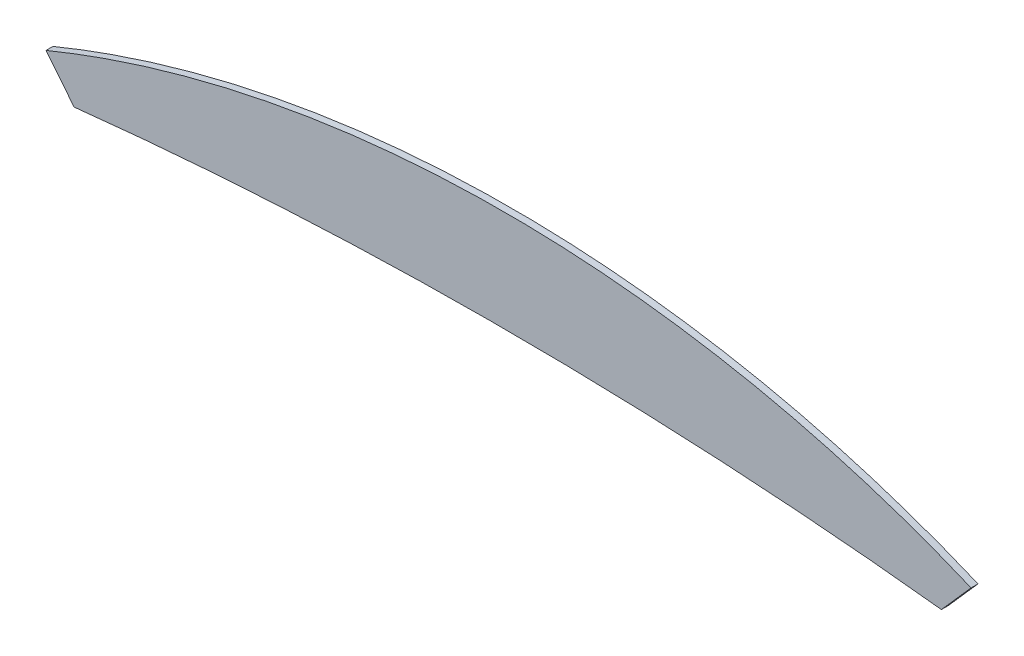
ISO-10303-21;
HEADER;
FILE_DESCRIPTION(('STEP AP214'),'2;1');
FILE_NAME('part.step','',(''),(''),'','','');
FILE_SCHEMA(('AUTOMOTIVE_DESIGN { 1 0 10303 214 1 1 1 1 }'));
ENDSEC;
DATA;
#1=APPLICATION_CONTEXT('core data for automotive mechanical design processes');
#2=APPLICATION_PROTOCOL_DEFINITION('international standard','automotive_design',2000,#1);
#3=PRODUCT_CONTEXT('',#1,'mechanical');
#4=PRODUCT('Part','Part','',(#3));
#5=PRODUCT_RELATED_PRODUCT_CATEGORY('part','',(#4));
#6=PRODUCT_DEFINITION_FORMATION('','',#4);
#7=PRODUCT_DEFINITION_CONTEXT('part definition',#1,'design');
#8=PRODUCT_DEFINITION('design','',#6,#7);
#9=PRODUCT_DEFINITION_SHAPE('','',#8);
#10=(LENGTH_UNIT() NAMED_UNIT(*) SI_UNIT(.MILLI.,.METRE.));
#11=(NAMED_UNIT(*) PLANE_ANGLE_UNIT() SI_UNIT($,.RADIAN.));
#12=(NAMED_UNIT(*) SI_UNIT($,.STERADIAN.) SOLID_ANGLE_UNIT());
#13=UNCERTAINTY_MEASURE_WITH_UNIT(LENGTH_MEASURE(1.E-05),#10,'distance_accuracy_value','');
#14=(GEOMETRIC_REPRESENTATION_CONTEXT(3) GLOBAL_UNCERTAINTY_ASSIGNED_CONTEXT((#13)) GLOBAL_UNIT_ASSIGNED_CONTEXT((#10,
#11,#12)) REPRESENTATION_CONTEXT('',''));
#15=CARTESIAN_POINT('',(0.,0.,0.));
#16=DIRECTION('',(0.,0.,1.));
#17=DIRECTION('',(1.,0.,0.));
#18=AXIS2_PLACEMENT_3D('',#15,#16,#17);
#19=CARTESIAN_POINT('',(45.6834775369586,30.1136495265154,0.1));
#20=CARTESIAN_POINT('',(51.9495722313651,30.793564023917,0.1));
#21=CARTESIAN_POINT('',(58.2118071714674,30.0912594323867,0.1));
#22=(BOUNDED_CURVE() B_SPLINE_CURVE(2,(#19,#20,#21),.UNSPECIFIED.,.F.,
.F.) B_SPLINE_CURVE_WITH_KNOTS((3,3),(1.96165351289814,2.23574331225039),
.UNSPECIFIED.) CURVE() GEOMETRIC_REPRESENTATION_ITEM() RATIONAL_B_SPLINE_CURVE((1.,
0.990624035929916,1.)) REPRESENTATION_ITEM(''));
#23=DIRECTION('',(0.,0.,-1.));
#24=VECTOR('',#23,1.);
#25=SURFACE_OF_LINEAR_EXTRUSION('',#22,#24);
#26=CARTESIAN_POINT('',(45.6834775369586,30.1136495265154,0.));
#27=CARTESIAN_POINT('',(51.9495722313651,30.793564023917,0.));
#28=CARTESIAN_POINT('',(58.2118071714674,30.0912594323867,0.));
#29=(BOUNDED_CURVE() B_SPLINE_CURVE(2,(#26,#27,#28),.UNSPECIFIED.,.F.,
.F.) B_SPLINE_CURVE_WITH_KNOTS((3,3),(1.96165351289814,2.23574331225039),
.UNSPECIFIED.) CURVE() GEOMETRIC_REPRESENTATION_ITEM() RATIONAL_B_SPLINE_CURVE((1.,
0.990624035929916,1.)) REPRESENTATION_ITEM(''));
#30=CARTESIAN_POINT('',(45.6834775369586,30.1136495265154,0.));
#31=VERTEX_POINT('',#30);
#32=CARTESIAN_POINT('',(58.2118071714674,30.0912594323867,0.));
#33=VERTEX_POINT('',#32);
#34=EDGE_CURVE('E120',#31,#33,#29,.T.);
#35=ORIENTED_EDGE('',*,*,#34,.T.);
#36=DIRECTION('',(0.,0.,-1.));
#37=VECTOR('',#36,1.);
#38=CARTESIAN_POINT('',(58.2118071714674,30.0912594323867,0.1));
#39=LINE('',#38,#37);
#40=CARTESIAN_POINT('',(58.2118071714674,30.0912594323867,0.1));
#41=VERTEX_POINT('',#40);
#42=EDGE_CURVE('E11',#41,#33,#39,.T.);
#43=ORIENTED_EDGE('',*,*,#42,.F.);
#44=CARTESIAN_POINT('',(45.6834775369586,30.1136495265154,0.1));
#45=VERTEX_POINT('',#44);
#46=EDGE_CURVE('E85',#45,#41,#22,.T.);
#47=ORIENTED_EDGE('',*,*,#46,.F.);
#48=DIRECTION('',(0.,0.,-1.));
#49=VECTOR('',#48,1.);
#50=CARTESIAN_POINT('',(45.6834775369586,30.1136495265154,0.1));
#51=LINE('',#50,#49);
#52=EDGE_CURVE('E93',#45,#31,#51,.T.);
#53=ORIENTED_EDGE('',*,*,#52,.T.);
#54=EDGE_LOOP('',(#35,#43,#47,#53));
#55=FACE_BOUND('',#54,.T.);
#56=ADVANCED_FACE('F33',(#55),#25,.F.);
#57=CARTESIAN_POINT('',(58.2118071714674,30.0912594323867,0.1));
#58=DIRECTION('',(-0.749928942685465,0.661518390464438,0.));
#59=DIRECTION('',(-0.661518390464438,-0.749928942685465,0.));
#60=AXIS2_PLACEMENT_3D('',#57,#58,#59);
#61=PLANE('',#60);
#62=CARTESIAN_POINT('',(58.2118071714674,30.0912594323867,0.));
#63=CARTESIAN_POINT('',(58.4261049720102,30.3341976867079,0.));
#64=CARTESIAN_POINT('',(58.6404027725529,30.5771359410291,0.));
#65=(BOUNDED_CURVE() B_SPLINE_CURVE(2,(#62,#63,#64),.UNSPECIFIED.,.F.,
.F.) B_SPLINE_CURVE_WITH_KNOTS((3,3),(0.961653512898143,1.96165351289814),
.UNSPECIFIED.) CURVE() GEOMETRIC_REPRESENTATION_ITEM() RATIONAL_B_SPLINE_CURVE((1.,1.,1.)) REPRESENTATION_ITEM(''));
#66=CARTESIAN_POINT('',(58.6404027725529,30.5771359410291,0.));
#67=VERTEX_POINT('',#66);
#68=EDGE_CURVE('E89',#33,#67,#65,.T.);
#69=ORIENTED_EDGE('',*,*,#68,.T.);
#70=DIRECTION('',(0.,0.,-1.));
#71=VECTOR('',#70,1.);
#72=CARTESIAN_POINT('',(58.6404027725529,30.5771359410291,0.1));
#73=LINE('',#72,#71);
#74=CARTESIAN_POINT('',(58.6404027725529,30.5771359410291,0.1));
#75=VERTEX_POINT('',#74);
#76=EDGE_CURVE('E42',#75,#67,#73,.T.);
#77=ORIENTED_EDGE('',*,*,#76,.F.);
#78=CARTESIAN_POINT('',(58.2118071714674,30.0912594323867,0.1));
#79=CARTESIAN_POINT('',(58.4261049720102,30.3341976867079,0.1));
#80=CARTESIAN_POINT('',(58.6404027725529,30.5771359410291,0.1));
#81=(BOUNDED_CURVE() B_SPLINE_CURVE(2,(#78,#79,#80),.UNSPECIFIED.,.F.,
.F.) B_SPLINE_CURVE_WITH_KNOTS((3,3),(0.961653512898143,1.96165351289814),
.UNSPECIFIED.) CURVE() GEOMETRIC_REPRESENTATION_ITEM() RATIONAL_B_SPLINE_CURVE((1.,1.,1.)) REPRESENTATION_ITEM(''));
#82=EDGE_CURVE('E80',#41,#75,#81,.T.);
#83=ORIENTED_EDGE('',*,*,#82,.F.);
#84=ORIENTED_EDGE('',*,*,#42,.T.);
#85=EDGE_LOOP('',(#69,#77,#83,#84));
#86=FACE_BOUND('',#85,.T.);
#87=ADVANCED_FACE('F88',(#86),#61,.F.);
#88=CARTESIAN_POINT('',(58.6404027725529,30.5771359410291,0.1));
#89=CARTESIAN_POINT('',(51.9726361940467,33.3866438042224,0.1));
#90=CARTESIAN_POINT('',(45.2773428980342,30.6193498043254,0.1));
#91=(BOUNDED_CURVE() B_SPLINE_CURVE(2,(#88,#89,#90),.UNSPECIFIED.,.F.,
.F.) B_SPLINE_CURVE_WITH_KNOTS((3,3),(0.,0.961653512898143),
.UNSPECIFIED.) CURVE() GEOMETRIC_REPRESENTATION_ITEM() RATIONAL_B_SPLINE_CURVE((1.,
0.886612840769222,1.)) REPRESENTATION_ITEM(''));
#92=DIRECTION('',(0.,0.,-1.));
#93=VECTOR('',#92,1.);
#94=SURFACE_OF_LINEAR_EXTRUSION('',#91,#93);
#95=CARTESIAN_POINT('',(58.6404027725529,30.5771359410291,0.));
#96=CARTESIAN_POINT('',(51.9726361940467,33.3866438042224,0.));
#97=CARTESIAN_POINT('',(45.2773428980342,30.6193498043254,0.));
#98=(BOUNDED_CURVE() B_SPLINE_CURVE(2,(#95,#96,#97),.UNSPECIFIED.,.F.,
.F.) B_SPLINE_CURVE_WITH_KNOTS((3,3),(0.,0.961653512898143),
.UNSPECIFIED.) CURVE() GEOMETRIC_REPRESENTATION_ITEM() RATIONAL_B_SPLINE_CURVE((1.,
0.886612840769222,1.)) REPRESENTATION_ITEM(''));
#99=CARTESIAN_POINT('',(45.2773428980341,30.6193498043253,0.));
#100=VERTEX_POINT('',#99);
#101=EDGE_CURVE('E67',#67,#100,#98,.T.);
#102=ORIENTED_EDGE('',*,*,#101,.T.);
#103=DIRECTION('',(0.,0.,-1.));
#104=VECTOR('',#103,1.);
#105=CARTESIAN_POINT('',(45.2773428980341,30.6193498043253,0.1));
#106=LINE('',#105,#104);
#107=CARTESIAN_POINT('',(45.2773428980341,30.6193498043253,0.1));
#108=VERTEX_POINT('',#107);
#109=EDGE_CURVE('E90',#108,#100,#106,.T.);
#110=ORIENTED_EDGE('',*,*,#109,.F.);
#111=EDGE_CURVE('E83',#75,#108,#91,.T.);
#112=ORIENTED_EDGE('',*,*,#111,.F.);
#113=ORIENTED_EDGE('',*,*,#76,.T.);
#114=EDGE_LOOP('',(#102,#110,#112,#113));
#115=FACE_BOUND('',#114,.T.);
#116=ADVANCED_FACE('F91',(#115),#94,.F.);
#117=CARTESIAN_POINT('',(45.2773428980341,30.6193498043253,0.1));
#118=DIRECTION('',(0.779683299889577,0.626174058767449,0.));
#119=DIRECTION('',(-0.626174058767449,0.779683299889577,0.));
#120=AXIS2_PLACEMENT_3D('',#117,#118,#119);
#121=PLANE('',#120);
#122=CARTESIAN_POINT('',(45.2773428980341,30.6193498043253,0.));
#123=CARTESIAN_POINT('',(45.4804102174963,30.3664996654204,0.));
#124=CARTESIAN_POINT('',(45.6834775369586,30.1136495265154,0.));
#125=(BOUNDED_CURVE() B_SPLINE_CURVE(2,(#122,#123,#124),.UNSPECIFIED.,.F.,
.F.) B_SPLINE_CURVE_WITH_KNOTS((3,3),(2.23574331225039,3.23574331225039),
.UNSPECIFIED.) CURVE() GEOMETRIC_REPRESENTATION_ITEM() RATIONAL_B_SPLINE_CURVE((1.,1.,1.)) REPRESENTATION_ITEM(''));
#126=EDGE_CURVE('E73',#100,#31,#125,.T.);
#127=ORIENTED_EDGE('',*,*,#126,.T.);
#128=ORIENTED_EDGE('',*,*,#52,.F.);
#129=CARTESIAN_POINT('',(45.2773428980341,30.6193498043253,0.1));
#130=CARTESIAN_POINT('',(45.4804102174963,30.3664996654204,0.1));
#131=CARTESIAN_POINT('',(45.6834775369586,30.1136495265154,0.1));
#132=(BOUNDED_CURVE() B_SPLINE_CURVE(2,(#129,#130,#131),.UNSPECIFIED.,.F.,
.F.) B_SPLINE_CURVE_WITH_KNOTS((3,3),(2.23574331225039,3.23574331225039),
.UNSPECIFIED.) CURVE() GEOMETRIC_REPRESENTATION_ITEM() RATIONAL_B_SPLINE_CURVE((1.,1.,1.)) REPRESENTATION_ITEM(''));
#133=EDGE_CURVE('E50',#108,#45,#132,.T.);
#134=ORIENTED_EDGE('',*,*,#133,.F.);
#135=ORIENTED_EDGE('',*,*,#109,.T.);
#136=EDGE_LOOP('',(#127,#128,#134,#135));
#137=FACE_BOUND('',#136,.T.);
#138=ADVANCED_FACE('F109',(#137),#121,.F.);
#139=CARTESIAN_POINT('',(51.9486027478678,30.4463816670321,0.1));
#140=DIRECTION('',(0.,0.,-1.));
#141=DIRECTION('',(-1.,0.,0.));
#142=AXIS2_PLACEMENT_3D('',#139,#140,#141);
#143=PLANE('',#142);
#144=ORIENTED_EDGE('',*,*,#46,.T.);
#145=ORIENTED_EDGE('',*,*,#82,.T.);
#146=ORIENTED_EDGE('',*,*,#111,.T.);
#147=ORIENTED_EDGE('',*,*,#133,.T.);
#148=EDGE_LOOP('',(#144,#145,#146,#147));
#149=FACE_BOUND('',#148,.T.);
#150=ADVANCED_FACE('F81',(#149),#143,.F.);
#151=CARTESIAN_POINT('',(51.9486027478678,30.4463816670321,0.));
#152=DIRECTION('',(0.,0.,-1.));
#153=DIRECTION('',(-1.,0.,0.));
#154=AXIS2_PLACEMENT_3D('',#151,#152,#153);
#155=PLANE('',#154);
#156=ORIENTED_EDGE('',*,*,#34,.F.);
#157=ORIENTED_EDGE('',*,*,#126,.F.);
#158=ORIENTED_EDGE('',*,*,#101,.F.);
#159=ORIENTED_EDGE('',*,*,#68,.F.);
#160=EDGE_LOOP('',(#156,#157,#158,#159));
#161=FACE_BOUND('',#160,.T.);
#162=ADVANCED_FACE('F147',(#161),#155,.T.);
#163=CLOSED_SHELL('',(#56,#87,#116,#138,#150,#162));
#164=MANIFOLD_SOLID_BREP('B2',#163);
#165=ADVANCED_BREP_SHAPE_REPRESENTATION('',(#18,#164),#14);
#166=SHAPE_DEFINITION_REPRESENTATION(#9,#165);
ENDSEC;
END-ISO-10303-21;
